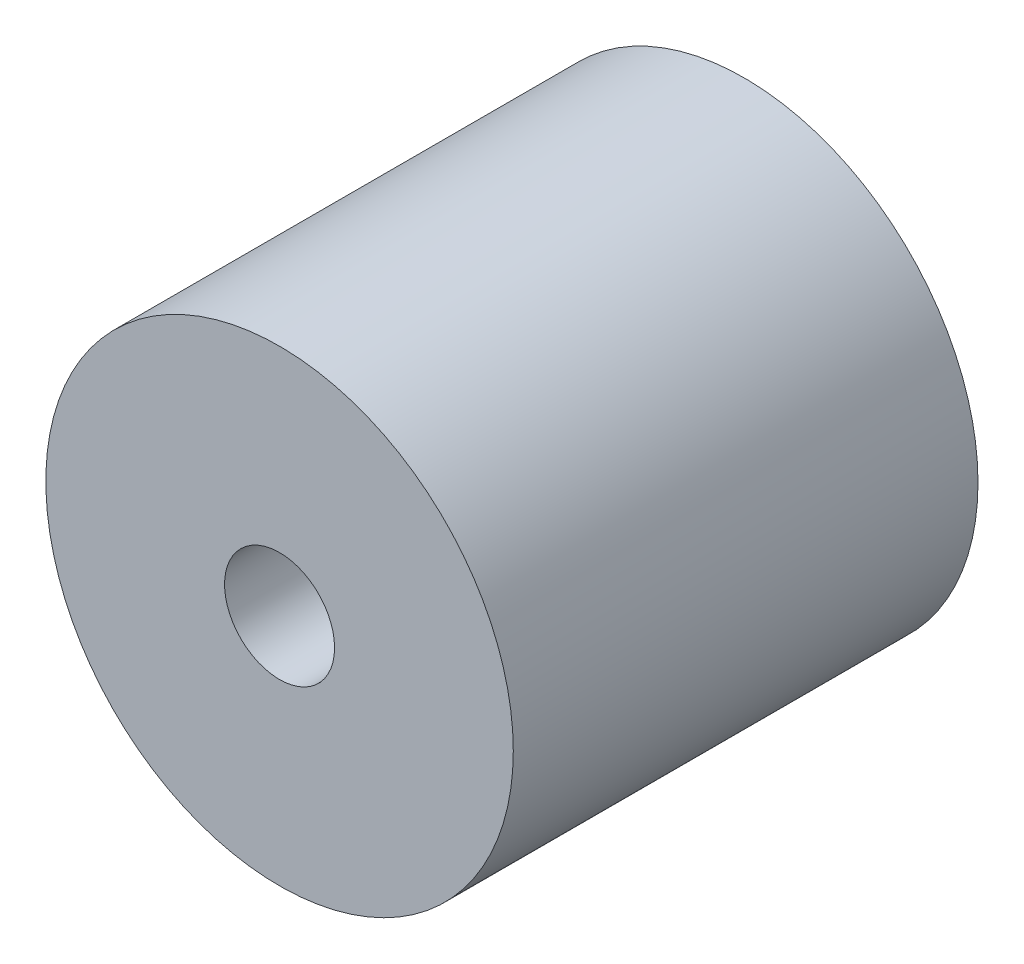
ISO-10303-21;
HEADER;
FILE_DESCRIPTION(('STEP AP214'),'2;1');
FILE_NAME('part.step','',(''),(''),'','','');
FILE_SCHEMA(('AUTOMOTIVE_DESIGN { 1 0 10303 214 1 1 1 1 }'));
ENDSEC;
DATA;
#1=APPLICATION_CONTEXT('core data for automotive mechanical design processes');
#2=APPLICATION_PROTOCOL_DEFINITION('international standard','automotive_design',2000,#1);
#3=PRODUCT_CONTEXT('',#1,'mechanical');
#4=PRODUCT('Part','Part','',(#3));
#5=PRODUCT_RELATED_PRODUCT_CATEGORY('part','',(#4));
#6=PRODUCT_DEFINITION_FORMATION('','',#4);
#7=PRODUCT_DEFINITION_CONTEXT('part definition',#1,'design');
#8=PRODUCT_DEFINITION('design','',#6,#7);
#9=PRODUCT_DEFINITION_SHAPE('','',#8);
#10=(LENGTH_UNIT() NAMED_UNIT(*) SI_UNIT(.MILLI.,.METRE.));
#11=(NAMED_UNIT(*) PLANE_ANGLE_UNIT() SI_UNIT($,.RADIAN.));
#12=(NAMED_UNIT(*) SI_UNIT($,.STERADIAN.) SOLID_ANGLE_UNIT());
#13=UNCERTAINTY_MEASURE_WITH_UNIT(LENGTH_MEASURE(1.E-05),#10,'distance_accuracy_value','');
#14=(GEOMETRIC_REPRESENTATION_CONTEXT(3) GLOBAL_UNCERTAINTY_ASSIGNED_CONTEXT((#13)) GLOBAL_UNIT_ASSIGNED_CONTEXT((#10,
#11,#12)) REPRESENTATION_CONTEXT('',''));
#15=CARTESIAN_POINT('',(0.,0.,0.));
#16=DIRECTION('',(0.,0.,1.));
#17=DIRECTION('',(1.,0.,0.));
#18=AXIS2_PLACEMENT_3D('',#15,#16,#17);
#19=CARTESIAN_POINT('',(0.,0.,4.225));
#20=DIRECTION('',(0.,0.,1.));
#21=DIRECTION('',(1.,0.,0.));
#22=AXIS2_PLACEMENT_3D('',#19,#20,#21);
#23=PLANE('',#22);
#24=CARTESIAN_POINT('',(0.,0.,4.225));
#25=DIRECTION('',(0.,0.,1.));
#26=DIRECTION('',(1.,0.,0.));
#27=AXIS2_PLACEMENT_3D('',#24,#25,#26);
#28=CIRCLE('',#27,2.125);
#29=CARTESIAN_POINT('',(2.125,0.,4.225));
#30=VERTEX_POINT('',#29);
#31=EDGE_CURVE('E10',#30,#30,#28,.T.);
#32=ORIENTED_EDGE('',*,*,#31,.T.);
#33=EDGE_LOOP('',(#32));
#34=FACE_BOUND('',#33,.T.);
#35=CARTESIAN_POINT('',(0.,0.,4.225));
#36=DIRECTION('',(0.,0.,1.));
#37=DIRECTION('',(1.,0.,0.));
#38=AXIS2_PLACEMENT_3D('',#35,#36,#37);
#39=CIRCLE('',#38,0.5);
#40=CARTESIAN_POINT('',(0.5,0.,4.225));
#41=VERTEX_POINT('',#40);
#42=EDGE_CURVE('E43',#41,#41,#39,.T.);
#43=ORIENTED_EDGE('',*,*,#42,.F.);
#44=EDGE_LOOP('',(#43));
#45=FACE_BOUND('',#44,.T.);
#46=ADVANCED_FACE('F32',(#34,#45),#23,.T.);
#47=CARTESIAN_POINT('',(0.,0.,0.));
#48=DIRECTION('',(0.,0.,1.));
#49=DIRECTION('',(1.,0.,0.));
#50=AXIS2_PLACEMENT_3D('',#47,#48,#49);
#51=PLANE('',#50);
#52=CARTESIAN_POINT('',(0.,0.,0.));
#53=DIRECTION('',(0.,0.,1.));
#54=DIRECTION('',(1.,0.,0.));
#55=AXIS2_PLACEMENT_3D('',#52,#53,#54);
#56=CIRCLE('',#55,2.125);
#57=CARTESIAN_POINT('',(2.125,0.,0.));
#58=VERTEX_POINT('',#57);
#59=EDGE_CURVE('E36',#58,#58,#56,.T.);
#60=ORIENTED_EDGE('',*,*,#59,.F.);
#61=EDGE_LOOP('',(#60));
#62=FACE_BOUND('',#61,.T.);
#63=CARTESIAN_POINT('',(0.,0.,0.));
#64=DIRECTION('',(0.,0.,1.));
#65=DIRECTION('',(1.,0.,0.));
#66=AXIS2_PLACEMENT_3D('',#63,#64,#65);
#67=CIRCLE('',#66,0.5);
#68=CARTESIAN_POINT('',(0.5,0.,0.));
#69=VERTEX_POINT('',#68);
#70=EDGE_CURVE('E45',#69,#69,#67,.T.);
#71=ORIENTED_EDGE('',*,*,#70,.T.);
#72=EDGE_LOOP('',(#71));
#73=FACE_BOUND('',#72,.T.);
#74=ADVANCED_FACE('F55',(#62,#73),#51,.F.);
#75=CARTESIAN_POINT('',(0.,0.,4.225));
#76=DIRECTION('',(0.,0.,-1.));
#77=DIRECTION('',(-1.,0.,0.));
#78=AXIS2_PLACEMENT_3D('',#75,#76,#77);
#79=CYLINDRICAL_SURFACE('',#78,2.125);
#80=ORIENTED_EDGE('',*,*,#31,.F.);
#81=EDGE_LOOP('',(#80));
#82=FACE_BOUND('',#81,.T.);
#83=ORIENTED_EDGE('',*,*,#59,.T.);
#84=EDGE_LOOP('',(#83));
#85=FACE_BOUND('',#84,.T.);
#86=ADVANCED_FACE('F34',(#82,#85),#79,.T.);
#87=CARTESIAN_POINT('',(0.,0.,4.225));
#88=DIRECTION('',(0.,0.,-1.));
#89=DIRECTION('',(-1.,0.,0.));
#90=AXIS2_PLACEMENT_3D('',#87,#88,#89);
#91=CYLINDRICAL_SURFACE('',#90,0.5);
#92=ORIENTED_EDGE('',*,*,#42,.T.);
#93=EDGE_LOOP('',(#92));
#94=FACE_BOUND('',#93,.T.);
#95=ORIENTED_EDGE('',*,*,#70,.F.);
#96=EDGE_LOOP('',(#95));
#97=FACE_BOUND('',#96,.T.);
#98=ADVANCED_FACE('F51',(#94,#97),#91,.F.);
#99=CLOSED_SHELL('',(#46,#74,#86,#98));
#100=MANIFOLD_SOLID_BREP('B2',#99);
#101=ADVANCED_BREP_SHAPE_REPRESENTATION('',(#18,#100),#14);
#102=SHAPE_DEFINITION_REPRESENTATION(#9,#101);
ENDSEC;
END-ISO-10303-21;
